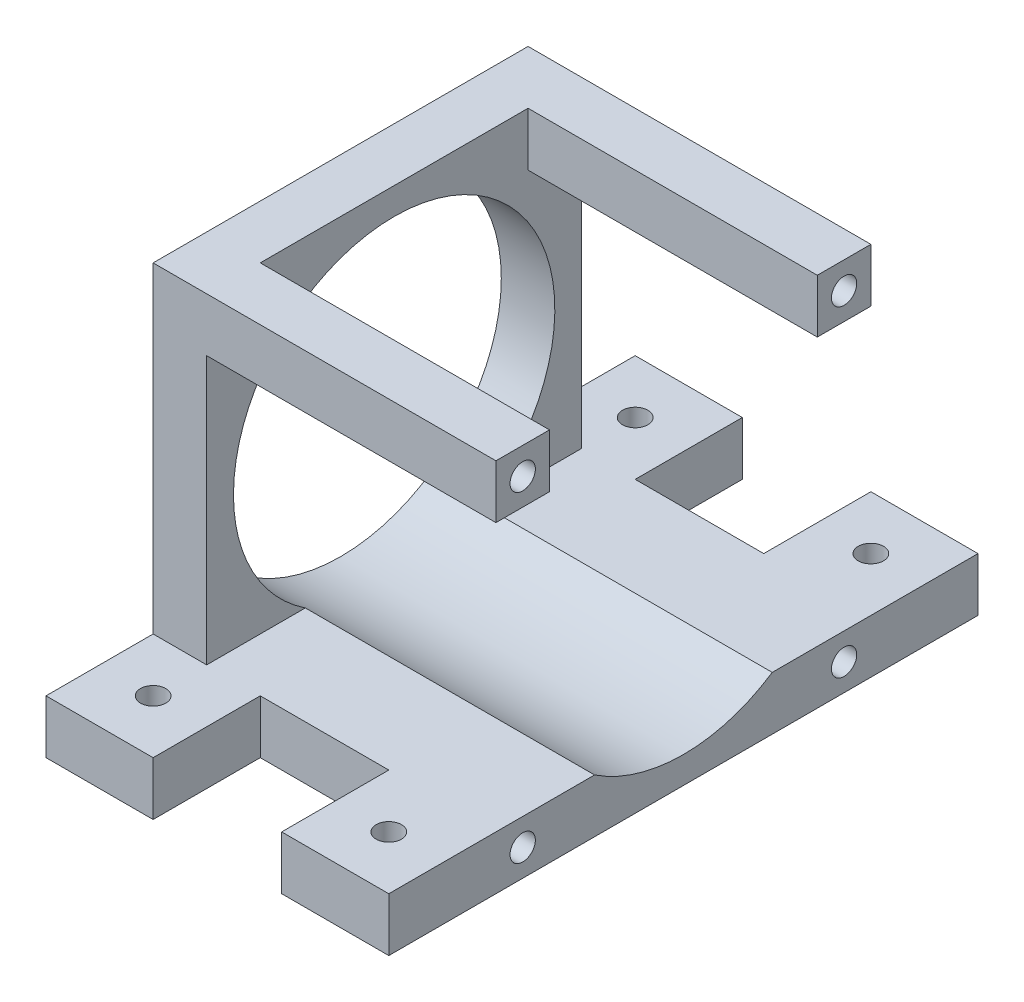
ISO-10303-21;
HEADER;
FILE_DESCRIPTION(('STEP AP214'),'2;1');
FILE_NAME('part.step','',(''),(''),'','','');
FILE_SCHEMA(('AUTOMOTIVE_DESIGN { 1 0 10303 214 1 1 1 1 }'));
ENDSEC;
DATA;
#1=APPLICATION_CONTEXT('core data for automotive mechanical design processes');
#2=APPLICATION_PROTOCOL_DEFINITION('international standard','automotive_design',2000,#1);
#3=PRODUCT_CONTEXT('',#1,'mechanical');
#4=PRODUCT('Part','Part','',(#3));
#5=PRODUCT_RELATED_PRODUCT_CATEGORY('part','',(#4));
#6=PRODUCT_DEFINITION_FORMATION('','',#4);
#7=PRODUCT_DEFINITION_CONTEXT('part definition',#1,'design');
#8=PRODUCT_DEFINITION('design','',#6,#7);
#9=PRODUCT_DEFINITION_SHAPE('','',#8);
#10=(LENGTH_UNIT() NAMED_UNIT(*) SI_UNIT(.MILLI.,.METRE.));
#11=(NAMED_UNIT(*) PLANE_ANGLE_UNIT() SI_UNIT($,.RADIAN.));
#12=(NAMED_UNIT(*) SI_UNIT($,.STERADIAN.) SOLID_ANGLE_UNIT());
#13=UNCERTAINTY_MEASURE_WITH_UNIT(LENGTH_MEASURE(1.E-05),#10,'distance_accuracy_value','');
#14=(GEOMETRIC_REPRESENTATION_CONTEXT(3) GLOBAL_UNCERTAINTY_ASSIGNED_CONTEXT((#13)) GLOBAL_UNIT_ASSIGNED_CONTEXT((#10,
#11,#12)) REPRESENTATION_CONTEXT('',''));
#15=CARTESIAN_POINT('',(0.,0.,0.));
#16=DIRECTION('',(0.,0.,1.));
#17=DIRECTION('',(1.,0.,0.));
#18=AXIS2_PLACEMENT_3D('',#15,#16,#17);
#19=CARTESIAN_POINT('',(0.,44.45,0.));
#20=DIRECTION('',(0.,0.,-1.));
#21=DIRECTION('',(-1.,0.,0.));
#22=AXIS2_PLACEMENT_3D('',#19,#20,#21);
#23=PLANE('',#22);
#24=DIRECTION('',(1.,0.,0.));
#25=VECTOR('',#24,1.);
#26=CARTESIAN_POINT('',(6.35,6.34999999999999,0.));
#27=LINE('',#26,#25);
#28=CARTESIAN_POINT('',(12.7,6.34999999999999,0.));
#29=VERTEX_POINT('',#28);
#30=CARTESIAN_POINT('',(27.94,6.34999999999999,0.));
#31=VERTEX_POINT('',#30);
#32=EDGE_CURVE('E58',#29,#31,#27,.T.);
#33=ORIENTED_EDGE('',*,*,#32,.F.);
#34=DIRECTION('',(0.,-1.,0.));
#35=VECTOR('',#34,1.);
#36=CARTESIAN_POINT('',(12.7,0.,0.));
#37=LINE('',#36,#35);
#38=CARTESIAN_POINT('',(12.7,0.,0.));
#39=VERTEX_POINT('',#38);
#40=EDGE_CURVE('E51',#29,#39,#37,.T.);
#41=ORIENTED_EDGE('',*,*,#40,.T.);
#42=DIRECTION('',(1.,0.,0.));
#43=VECTOR('',#42,1.);
#44=CARTESIAN_POINT('',(0.,0.,0.));
#45=LINE('',#44,#43);
#46=CARTESIAN_POINT('',(27.94,0.,0.));
#47=VERTEX_POINT('',#46);
#48=EDGE_CURVE('E37',#39,#47,#45,.T.);
#49=ORIENTED_EDGE('',*,*,#48,.T.);
#50=DIRECTION('',(0.,1.,0.));
#51=VECTOR('',#50,1.);
#52=CARTESIAN_POINT('',(27.94,0.,0.));
#53=LINE('',#52,#51);
#54=EDGE_CURVE('E236',#47,#31,#53,.T.);
#55=ORIENTED_EDGE('',*,*,#54,.T.);
#56=EDGE_LOOP('',(#33,#41,#49,#55));
#57=FACE_BOUND('',#56,.T.);
#58=ADVANCED_FACE('F33',(#57),#23,.F.);
#59=CARTESIAN_POINT('',(0.,44.45,-44.45));
#60=DIRECTION('',(0.,0.,1.));
#61=DIRECTION('',(1.,0.,0.));
#62=AXIS2_PLACEMENT_3D('',#59,#60,#61);
#63=PLANE('',#62);
#64=DIRECTION('',(1.,0.,0.));
#65=VECTOR('',#64,1.);
#66=CARTESIAN_POINT('',(0.,6.35,-44.45));
#67=LINE('',#66,#65);
#68=CARTESIAN_POINT('',(0.,6.35,-44.45));
#69=VERTEX_POINT('',#68);
#70=CARTESIAN_POINT('',(6.35,6.34999999999999,-44.45));
#71=VERTEX_POINT('',#70);
#72=EDGE_CURVE('E434',#69,#71,#67,.T.);
#73=ORIENTED_EDGE('',*,*,#72,.F.);
#74=DIRECTION('',(0.,-1.,0.));
#75=VECTOR('',#74,1.);
#76=CARTESIAN_POINT('',(0.,44.45,-44.45));
#77=LINE('',#76,#75);
#78=CARTESIAN_POINT('',(0.,44.45,-44.45));
#79=VERTEX_POINT('',#78);
#80=EDGE_CURVE('E302',#79,#69,#77,.T.);
#81=ORIENTED_EDGE('',*,*,#80,.F.);
#82=DIRECTION('',(-1.,0.,0.));
#83=VECTOR('',#82,1.);
#84=CARTESIAN_POINT('',(0.,44.45,-44.45));
#85=LINE('',#84,#83);
#86=CARTESIAN_POINT('',(40.64,44.45,-44.45));
#87=VERTEX_POINT('',#86);
#88=EDGE_CURVE('E301',#87,#79,#85,.T.);
#89=ORIENTED_EDGE('',*,*,#88,.F.);
#90=DIRECTION('',(0.,1.,0.));
#91=VECTOR('',#90,1.);
#92=CARTESIAN_POINT('',(40.64,44.45,-44.45));
#93=LINE('',#92,#91);
#94=CARTESIAN_POINT('',(40.64,38.1,-44.45));
#95=VERTEX_POINT('',#94);
#96=EDGE_CURVE('E352',#95,#87,#93,.T.);
#97=ORIENTED_EDGE('',*,*,#96,.F.);
#98=DIRECTION('',(-1.,0.,0.));
#99=VECTOR('',#98,1.);
#100=CARTESIAN_POINT('',(40.64,38.1,-44.45));
#101=LINE('',#100,#99);
#102=CARTESIAN_POINT('',(6.35,38.1,-44.45));
#103=VERTEX_POINT('',#102);
#104=EDGE_CURVE('E362',#95,#103,#101,.T.);
#105=ORIENTED_EDGE('',*,*,#104,.T.);
#106=DIRECTION('',(0.,-1.,0.));
#107=VECTOR('',#106,1.);
#108=CARTESIAN_POINT('',(6.35000000000001,44.45,-44.45));
#109=LINE('',#108,#107);
#110=EDGE_CURVE('E270',#103,#71,#109,.T.);
#111=ORIENTED_EDGE('',*,*,#110,.T.);
#112=EDGE_LOOP('',(#73,#81,#89,#97,#105,#111));
#113=FACE_BOUND('',#112,.T.);
#114=ADVANCED_FACE('F478',(#113),#63,.F.);
#115=DIRECTION('',(0.,-1.,0.));
#116=VECTOR('',#115,1.);
#117=CARTESIAN_POINT('',(12.7,0.,-44.45));
#118=LINE('',#117,#116);
#119=CARTESIAN_POINT('',(12.7,6.35,-44.45));
#120=VERTEX_POINT('',#119);
#121=CARTESIAN_POINT('',(12.7,0.,-44.45));
#122=VERTEX_POINT('',#121);
#123=EDGE_CURVE('E402',#120,#122,#118,.T.);
#124=ORIENTED_EDGE('',*,*,#123,.F.);
#125=DIRECTION('',(1.,0.,0.));
#126=VECTOR('',#125,1.);
#127=CARTESIAN_POINT('',(6.35,6.34999999999999,-44.45));
#128=LINE('',#127,#126);
#129=CARTESIAN_POINT('',(27.94,6.35,-44.45));
#130=VERTEX_POINT('',#129);
#131=EDGE_CURVE('E258',#120,#130,#128,.T.);
#132=ORIENTED_EDGE('',*,*,#131,.T.);
#133=DIRECTION('',(0.,1.,0.));
#134=VECTOR('',#133,1.);
#135=CARTESIAN_POINT('',(27.94,0.,-44.45));
#136=LINE('',#135,#134);
#137=CARTESIAN_POINT('',(27.94,0.,-44.45));
#138=VERTEX_POINT('',#137);
#139=EDGE_CURVE('E313',#138,#130,#136,.T.);
#140=ORIENTED_EDGE('',*,*,#139,.F.);
#141=DIRECTION('',(-1.,0.,0.));
#142=VECTOR('',#141,1.);
#143=CARTESIAN_POINT('',(0.,0.,-44.45));
#144=LINE('',#143,#142);
#145=EDGE_CURVE('E299',#138,#122,#144,.T.);
#146=ORIENTED_EDGE('',*,*,#145,.T.);
#147=EDGE_LOOP('',(#124,#132,#140,#146));
#148=FACE_BOUND('',#147,.T.);
#149=ADVANCED_FACE('F399',(#148),#63,.F.);
#150=CARTESIAN_POINT('',(6.35000000000001,44.45,0.));
#151=DIRECTION('',(1.,0.,0.));
#152=DIRECTION('',(0.,1.,0.));
#153=AXIS2_PLACEMENT_3D('',#150,#151,#152);
#154=PLANE('',#153);
#155=DIRECTION('',(0.,0.,-1.));
#156=VECTOR('',#155,1.);
#157=CARTESIAN_POINT('',(6.35,38.1,-44.45));
#158=LINE('',#157,#156);
#159=CARTESIAN_POINT('',(6.35,38.1,-38.1));
#160=VERTEX_POINT('',#159);
#161=EDGE_CURVE('E356',#160,#103,#158,.T.);
#162=ORIENTED_EDGE('',*,*,#161,.F.);
#163=DIRECTION('',(0.,-1.,0.));
#164=VECTOR('',#163,1.);
#165=CARTESIAN_POINT('',(6.35000000000001,44.45,-38.1));
#166=LINE('',#165,#164);
#167=CARTESIAN_POINT('',(6.35000000000001,44.45,-38.1));
#168=VERTEX_POINT('',#167);
#169=EDGE_CURVE('E349',#168,#160,#166,.T.);
#170=ORIENTED_EDGE('',*,*,#169,.F.);
#171=DIRECTION('',(0.,0.,-1.));
#172=VECTOR('',#171,1.);
#173=CARTESIAN_POINT('',(6.35000000000001,44.45,0.));
#174=LINE('',#173,#172);
#175=CARTESIAN_POINT('',(6.35000000000001,44.45,-6.35));
#176=VERTEX_POINT('',#175);
#177=EDGE_CURVE('E281',#176,#168,#174,.T.);
#178=ORIENTED_EDGE('',*,*,#177,.F.);
#179=DIRECTION('',(0.,1.,0.));
#180=VECTOR('',#179,1.);
#181=CARTESIAN_POINT('',(6.35000000000001,44.45,-6.35));
#182=LINE('',#181,#180);
#183=CARTESIAN_POINT('',(6.35,38.1,-6.35));
#184=VERTEX_POINT('',#183);
#185=EDGE_CURVE('E377',#184,#176,#182,.T.);
#186=ORIENTED_EDGE('',*,*,#185,.F.);
#187=DIRECTION('',(0.,0.,-1.));
#188=VECTOR('',#187,1.);
#189=CARTESIAN_POINT('',(6.35,38.1,0.));
#190=LINE('',#189,#188);
#191=CARTESIAN_POINT('',(6.35,38.1,0.));
#192=VERTEX_POINT('',#191);
#193=EDGE_CURVE('E372',#192,#184,#190,.T.);
#194=ORIENTED_EDGE('',*,*,#193,.F.);
#195=DIRECTION('',(0.,-1.,0.));
#196=VECTOR('',#195,1.);
#197=CARTESIAN_POINT('',(6.35000000000001,44.45,0.));
#198=LINE('',#197,#196);
#199=CARTESIAN_POINT('',(6.35,6.34999999999999,0.));
#200=VERTEX_POINT('',#199);
#201=EDGE_CURVE('E269',#192,#200,#198,.T.);
#202=ORIENTED_EDGE('',*,*,#201,.T.);
#203=DIRECTION('',(0.,0.,-1.));
#204=VECTOR('',#203,1.);
#205=CARTESIAN_POINT('',(6.35,6.34999999999999,0.));
#206=LINE('',#205,#204);
#207=CARTESIAN_POINT('',(6.35,6.34999999999999,-11.6947162906216));
#208=VERTEX_POINT('',#207);
#209=EDGE_CURVE('E285',#200,#208,#206,.T.);
#210=ORIENTED_EDGE('',*,*,#209,.T.);
#211=CARTESIAN_POINT('',(6.35,22.225,-22.225));
#212=DIRECTION('',(1.,0.,0.));
#213=DIRECTION('',(0.,1.,0.));
#214=AXIS2_PLACEMENT_3D('',#211,#212,#213);
#215=CIRCLE('',#214,19.05);
#216=CARTESIAN_POINT('',(6.35,6.34999999999999,-32.7552837093784));
#217=VERTEX_POINT('',#216);
#218=EDGE_CURVE('E43',#208,#217,#215,.F.);
#219=ORIENTED_EDGE('',*,*,#218,.T.);
#220=EDGE_CURVE('E288',#217,#71,#206,.T.);
#221=ORIENTED_EDGE('',*,*,#220,.T.);
#222=ORIENTED_EDGE('',*,*,#110,.F.);
#223=EDGE_LOOP('',(#162,#170,#178,#186,#194,#202,#210,#219,#221,#222));
#224=FACE_BOUND('',#223,.T.);
#225=ADVANCED_FACE('F489',(#224),#154,.T.);
#226=DIRECTION('',(0.,-1.,0.));
#227=VECTOR('',#226,1.);
#228=CARTESIAN_POINT('',(0.,44.45,0.));
#229=LINE('',#228,#227);
#230=CARTESIAN_POINT('',(0.,44.45,0.));
#231=VERTEX_POINT('',#230);
#232=CARTESIAN_POINT('',(0.,6.35,0.));
#233=VERTEX_POINT('',#232);
#234=EDGE_CURVE('E501',#231,#233,#229,.T.);
#235=ORIENTED_EDGE('',*,*,#234,.T.);
#236=DIRECTION('',(1.,0.,0.));
#237=VECTOR('',#236,1.);
#238=CARTESIAN_POINT('',(0.,6.35,0.));
#239=LINE('',#238,#237);
#240=EDGE_CURVE('E217',#233,#200,#239,.T.);
#241=ORIENTED_EDGE('',*,*,#240,.T.);
#242=ORIENTED_EDGE('',*,*,#201,.F.);
#243=DIRECTION('',(-1.,0.,0.));
#244=VECTOR('',#243,1.);
#245=CARTESIAN_POINT('',(40.64,38.1,0.));
#246=LINE('',#245,#244);
#247=CARTESIAN_POINT('',(40.64,38.1,0.));
#248=VERTEX_POINT('',#247);
#249=EDGE_CURVE('E274',#248,#192,#246,.T.);
#250=ORIENTED_EDGE('',*,*,#249,.F.);
#251=DIRECTION('',(0.,-1.,0.));
#252=VECTOR('',#251,1.);
#253=CARTESIAN_POINT('',(40.64,44.45,0.));
#254=LINE('',#253,#252);
#255=CARTESIAN_POINT('',(40.64,44.45,0.));
#256=VERTEX_POINT('',#255);
#257=EDGE_CURVE('E373',#256,#248,#254,.T.);
#258=ORIENTED_EDGE('',*,*,#257,.F.);
#259=DIRECTION('',(1.,0.,0.));
#260=VECTOR('',#259,1.);
#261=CARTESIAN_POINT('',(0.,44.45,0.));
#262=LINE('',#261,#260);
#263=EDGE_CURVE('E298',#231,#256,#262,.T.);
#264=ORIENTED_EDGE('',*,*,#263,.F.);
#265=EDGE_LOOP('',(#235,#241,#242,#250,#258,#264));
#266=FACE_BOUND('',#265,.T.);
#267=ADVANCED_FACE('F480',(#266),#23,.F.);
#268=CARTESIAN_POINT('',(40.64,44.45,0.));
#269=DIRECTION('',(-1.,0.,0.));
#270=DIRECTION('',(0.,0.,1.));
#271=AXIS2_PLACEMENT_3D('',#268,#269,#270);
#272=PLANE('',#271);
#273=CARTESIAN_POINT('',(40.64,3.175,-3.175));
#274=DIRECTION('',(1.,0.,0.));
#275=DIRECTION('',(0.,1.,0.));
#276=AXIS2_PLACEMENT_3D('',#273,#274,#275);
#277=CIRCLE('',#276,1.5);
#278=CARTESIAN_POINT('',(40.64,4.675,-3.175));
#279=VERTEX_POINT('',#278);
#280=EDGE_CURVE('E330',#279,#279,#277,.T.);
#281=ORIENTED_EDGE('',*,*,#280,.F.);
#282=EDGE_LOOP('',(#281));
#283=FACE_BOUND('',#282,.T.);
#284=CARTESIAN_POINT('',(40.64,3.17499999999999,-41.275));
#285=DIRECTION('',(1.,0.,0.));
#286=DIRECTION('',(0.,1.,0.));
#287=AXIS2_PLACEMENT_3D('',#284,#285,#286);
#288=CIRCLE('',#287,1.5);
#289=CARTESIAN_POINT('',(40.64,4.675,-41.275));
#290=VERTEX_POINT('',#289);
#291=EDGE_CURVE('E329',#290,#290,#288,.T.);
#292=ORIENTED_EDGE('',*,*,#291,.F.);
#293=EDGE_LOOP('',(#292));
#294=FACE_BOUND('',#293,.T.);
#295=DIRECTION('',(0.,0.,-1.));
#296=VECTOR('',#295,1.);
#297=CARTESIAN_POINT('',(40.64,6.34999999999999,0.));
#298=LINE('',#297,#296);
#299=CARTESIAN_POINT('',(40.64,6.35,12.7));
#300=VERTEX_POINT('',#299);
#301=CARTESIAN_POINT('',(40.64,6.34999999999999,-11.6947162906216));
#302=VERTEX_POINT('',#301);
#303=EDGE_CURVE('E289',#300,#302,#298,.T.);
#304=ORIENTED_EDGE('',*,*,#303,.F.);
#305=DIRECTION('',(0.,-1.,0.));
#306=VECTOR('',#305,1.);
#307=CARTESIAN_POINT('',(40.64,0.,12.7));
#308=LINE('',#307,#306);
#309=CARTESIAN_POINT('',(40.64,0.,12.7));
#310=VERTEX_POINT('',#309);
#311=EDGE_CURVE('E237',#300,#310,#308,.T.);
#312=ORIENTED_EDGE('',*,*,#311,.T.);
#313=DIRECTION('',(0.,0.,-1.));
#314=VECTOR('',#313,1.);
#315=CARTESIAN_POINT('',(40.64,0.,0.));
#316=LINE('',#315,#314);
#317=CARTESIAN_POINT('',(40.64,0.,-57.15));
#318=VERTEX_POINT('',#317);
#319=EDGE_CURVE('E305',#310,#318,#316,.T.);
#320=ORIENTED_EDGE('',*,*,#319,.T.);
#321=DIRECTION('',(0.,-1.,0.));
#322=VECTOR('',#321,1.);
#323=CARTESIAN_POINT('',(40.64,0.,-57.15));
#324=LINE('',#323,#322);
#325=CARTESIAN_POINT('',(40.64,6.35,-57.15));
#326=VERTEX_POINT('',#325);
#327=EDGE_CURVE('E317',#326,#318,#324,.T.);
#328=ORIENTED_EDGE('',*,*,#327,.F.);
#329=CARTESIAN_POINT('',(40.64,6.34999999999999,-32.7552837093784));
#330=VERTEX_POINT('',#329);
#331=EDGE_CURVE('E277',#330,#326,#298,.T.);
#332=ORIENTED_EDGE('',*,*,#331,.F.);
#333=CARTESIAN_POINT('',(40.64,22.225,-22.225));
#334=DIRECTION('',(-1.,0.,0.));
#335=DIRECTION('',(0.,0.,1.));
#336=AXIS2_PLACEMENT_3D('',#333,#334,#335);
#337=CIRCLE('',#336,19.05);
#338=EDGE_CURVE('E207',#330,#302,#337,.T.);
#339=ORIENTED_EDGE('',*,*,#338,.T.);
#340=EDGE_LOOP('',(#304,#312,#320,#328,#332,#339));
#341=FACE_BOUND('',#340,.T.);
#342=ADVANCED_FACE('F488',(#283,#294,#341),#272,.F.);
#343=CARTESIAN_POINT('',(0.,44.45,0.));
#344=DIRECTION('',(0.,-1.,0.));
#345=DIRECTION('',(0.,0.,-1.));
#346=AXIS2_PLACEMENT_3D('',#343,#344,#345);
#347=PLANE('',#346);
#348=ORIENTED_EDGE('',*,*,#263,.T.);
#349=DIRECTION('',(0.,0.,1.));
#350=VECTOR('',#349,1.);
#351=CARTESIAN_POINT('',(40.64,44.45,0.));
#352=LINE('',#351,#350);
#353=CARTESIAN_POINT('',(40.64,44.45,-6.35));
#354=VERTEX_POINT('',#353);
#355=EDGE_CURVE('E381',#354,#256,#352,.T.);
#356=ORIENTED_EDGE('',*,*,#355,.F.);
#357=DIRECTION('',(-1.,0.,0.));
#358=VECTOR('',#357,1.);
#359=CARTESIAN_POINT('',(40.64,44.45,-6.35));
#360=LINE('',#359,#358);
#361=EDGE_CURVE('E384',#354,#176,#360,.T.);
#362=ORIENTED_EDGE('',*,*,#361,.T.);
#363=ORIENTED_EDGE('',*,*,#177,.T.);
#364=DIRECTION('',(-1.,0.,0.));
#365=VECTOR('',#364,1.);
#366=CARTESIAN_POINT('',(40.64,44.45,-38.1));
#367=LINE('',#366,#365);
#368=CARTESIAN_POINT('',(40.64,44.45,-38.1));
#369=VERTEX_POINT('',#368);
#370=EDGE_CURVE('E370',#369,#168,#367,.T.);
#371=ORIENTED_EDGE('',*,*,#370,.F.);
#372=DIRECTION('',(0.,0.,1.));
#373=VECTOR('',#372,1.);
#374=CARTESIAN_POINT('',(40.64,44.45,-44.45));
#375=LINE('',#374,#373);
#376=EDGE_CURVE('E355',#87,#369,#375,.T.);
#377=ORIENTED_EDGE('',*,*,#376,.F.);
#378=ORIENTED_EDGE('',*,*,#88,.T.);
#379=DIRECTION('',(0.,0.,1.));
#380=VECTOR('',#379,1.);
#381=CARTESIAN_POINT('',(0.,44.45,0.));
#382=LINE('',#381,#380);
#383=EDGE_CURVE('E295',#79,#231,#382,.T.);
#384=ORIENTED_EDGE('',*,*,#383,.T.);
#385=EDGE_LOOP('',(#348,#356,#362,#363,#371,#377,#378,#384));
#386=FACE_BOUND('',#385,.T.);
#387=ADVANCED_FACE('F495',(#386),#347,.F.);
#388=CARTESIAN_POINT('',(40.64,22.225,-22.225));
#389=DIRECTION('',(-1.,0.,0.));
#390=DIRECTION('',(0.,0.,1.));
#391=AXIS2_PLACEMENT_3D('',#388,#389,#390);
#392=CYLINDRICAL_SURFACE('',#391,19.05);
#393=CARTESIAN_POINT('',(0.,22.225,-22.225));
#394=DIRECTION('',(-1.,0.,0.));
#395=DIRECTION('',(0.,0.,1.));
#396=AXIS2_PLACEMENT_3D('',#393,#394,#395);
#397=CIRCLE('',#396,19.05);
#398=CARTESIAN_POINT('',(0.,22.225,-3.175));
#399=VERTEX_POINT('',#398);
#400=EDGE_CURVE('E284',#399,#399,#397,.T.);
#401=ORIENTED_EDGE('',*,*,#400,.T.);
#402=EDGE_LOOP('',(#401));
#403=FACE_BOUND('',#402,.T.);
#404=DIRECTION('',(-1.,0.,0.));
#405=VECTOR('',#404,1.);
#406=CARTESIAN_POINT('',(40.64,6.34999999999999,-32.7552837093784));
#407=LINE('',#406,#405);
#408=EDGE_CURVE('E11',#217,#330,#407,.F.);
#409=ORIENTED_EDGE('',*,*,#408,.F.);
#410=ORIENTED_EDGE('',*,*,#218,.F.);
#411=DIRECTION('',(-1.,0.,0.));
#412=VECTOR('',#411,1.);
#413=CARTESIAN_POINT('',(40.64,6.34999999999999,-11.6947162906216));
#414=LINE('',#413,#412);
#415=EDGE_CURVE('E506',#302,#208,#414,.T.);
#416=ORIENTED_EDGE('',*,*,#415,.F.);
#417=ORIENTED_EDGE('',*,*,#338,.F.);
#418=EDGE_LOOP('',(#409,#410,#416,#417));
#419=FACE_BOUND('',#418,.T.);
#420=ADVANCED_FACE('F520',(#403,#419),#392,.F.);
#421=CARTESIAN_POINT('',(0.,44.45,0.));
#422=DIRECTION('',(1.,0.,0.));
#423=DIRECTION('',(0.,0.,-1.));
#424=AXIS2_PLACEMENT_3D('',#421,#422,#423);
#425=PLANE('',#424);
#426=ORIENTED_EDGE('',*,*,#400,.F.);
#427=EDGE_LOOP('',(#426));
#428=FACE_BOUND('',#427,.T.);
#429=DIRECTION('',(0.,0.,1.));
#430=VECTOR('',#429,1.);
#431=CARTESIAN_POINT('',(0.,0.,0.));
#432=LINE('',#431,#430);
#433=CARTESIAN_POINT('',(0.,0.,-57.15));
#434=VERTEX_POINT('',#433);
#435=CARTESIAN_POINT('',(0.,0.,12.7));
#436=VERTEX_POINT('',#435);
#437=EDGE_CURVE('E196',#434,#436,#432,.T.);
#438=ORIENTED_EDGE('',*,*,#437,.T.);
#439=DIRECTION('',(0.,1.,0.));
#440=VECTOR('',#439,1.);
#441=CARTESIAN_POINT('',(0.,0.,12.7));
#442=LINE('',#441,#440);
#443=CARTESIAN_POINT('',(0.,6.35,12.7));
#444=VERTEX_POINT('',#443);
#445=EDGE_CURVE('E198',#436,#444,#442,.T.);
#446=ORIENTED_EDGE('',*,*,#445,.T.);
#447=DIRECTION('',(0.,0.,-1.));
#448=VECTOR('',#447,1.);
#449=CARTESIAN_POINT('',(0.,6.35,12.7));
#450=LINE('',#449,#448);
#451=EDGE_CURVE('E228',#444,#233,#450,.T.);
#452=ORIENTED_EDGE('',*,*,#451,.T.);
#453=ORIENTED_EDGE('',*,*,#234,.F.);
#454=ORIENTED_EDGE('',*,*,#383,.F.);
#455=ORIENTED_EDGE('',*,*,#80,.T.);
#456=DIRECTION('',(0.,0.,1.));
#457=VECTOR('',#456,1.);
#458=CARTESIAN_POINT('',(0.,6.35,-57.15));
#459=LINE('',#458,#457);
#460=CARTESIAN_POINT('',(0.,6.35,-57.15));
#461=VERTEX_POINT('',#460);
#462=EDGE_CURVE('E318',#461,#69,#459,.T.);
#463=ORIENTED_EDGE('',*,*,#462,.F.);
#464=DIRECTION('',(0.,1.,0.));
#465=VECTOR('',#464,1.);
#466=CARTESIAN_POINT('',(0.,0.,-57.15));
#467=LINE('',#466,#465);
#468=EDGE_CURVE('E202',#434,#461,#467,.T.);
#469=ORIENTED_EDGE('',*,*,#468,.F.);
#470=EDGE_LOOP('',(#438,#446,#452,#453,#454,#455,#463,#469));
#471=FACE_BOUND('',#470,.T.);
#472=ADVANCED_FACE('F35',(#428,#471),#425,.F.);
#473=CARTESIAN_POINT('',(0.,0.,0.));
#474=DIRECTION('',(0.,-1.,0.));
#475=DIRECTION('',(0.,0.,-1.));
#476=AXIS2_PLACEMENT_3D('',#473,#474,#475);
#477=PLANE('',#476);
#478=CARTESIAN_POINT('',(34.29,0.,6.34999999999999));
#479=DIRECTION('',(0.,-1.,0.));
#480=DIRECTION('',(0.,0.,-1.));
#481=AXIS2_PLACEMENT_3D('',#478,#479,#480);
#482=CIRCLE('',#481,1.5);
#483=CARTESIAN_POINT('',(34.29,0.,4.84999999999999));
#484=VERTEX_POINT('',#483);
#485=EDGE_CURVE('E579',#484,#484,#482,.F.);
#486=ORIENTED_EDGE('',*,*,#485,.T.);
#487=EDGE_LOOP('',(#486));
#488=FACE_BOUND('',#487,.T.);
#489=CARTESIAN_POINT('',(6.34999999999999,0.,6.34999999999999));
#490=DIRECTION('',(0.,-1.,0.));
#491=DIRECTION('',(0.,0.,-1.));
#492=AXIS2_PLACEMENT_3D('',#489,#490,#491);
#493=CIRCLE('',#492,1.5);
#494=CARTESIAN_POINT('',(6.34999999999999,0.,4.85));
#495=VERTEX_POINT('',#494);
#496=EDGE_CURVE('E230',#495,#495,#493,.F.);
#497=ORIENTED_EDGE('',*,*,#496,.T.);
#498=EDGE_LOOP('',(#497));
#499=FACE_BOUND('',#498,.T.);
#500=CARTESIAN_POINT('',(34.29,0.,-50.8));
#501=DIRECTION('',(0.,-1.,0.));
#502=DIRECTION('',(0.,0.,-1.));
#503=AXIS2_PLACEMENT_3D('',#500,#501,#502);
#504=CIRCLE('',#503,1.5);
#505=CARTESIAN_POINT('',(34.29,0.,-52.3));
#506=VERTEX_POINT('',#505);
#507=EDGE_CURVE('E448',#506,#506,#504,.T.);
#508=ORIENTED_EDGE('',*,*,#507,.F.);
#509=EDGE_LOOP('',(#508));
#510=FACE_BOUND('',#509,.T.);
#511=CARTESIAN_POINT('',(6.34999999999999,0.,-50.8));
#512=DIRECTION('',(0.,-1.,0.));
#513=DIRECTION('',(0.,0.,-1.));
#514=AXIS2_PLACEMENT_3D('',#511,#512,#513);
#515=CIRCLE('',#514,1.5);
#516=CARTESIAN_POINT('',(6.34999999999999,0.,-52.3));
#517=VERTEX_POINT('',#516);
#518=EDGE_CURVE('E437',#517,#517,#515,.T.);
#519=ORIENTED_EDGE('',*,*,#518,.F.);
#520=EDGE_LOOP('',(#519));
#521=FACE_BOUND('',#520,.T.);
#522=ORIENTED_EDGE('',*,*,#437,.F.);
#523=DIRECTION('',(-1.,0.,0.));
#524=VECTOR('',#523,1.);
#525=CARTESIAN_POINT('',(0.,0.,-57.15));
#526=LINE('',#525,#524);
#527=CARTESIAN_POINT('',(12.7,0.,-57.15));
#528=VERTEX_POINT('',#527);
#529=EDGE_CURVE('E432',#528,#434,#526,.T.);
#530=ORIENTED_EDGE('',*,*,#529,.F.);
#531=DIRECTION('',(0.,0.,1.));
#532=VECTOR('',#531,1.);
#533=CARTESIAN_POINT('',(12.7,0.,-57.15));
#534=LINE('',#533,#532);
#535=EDGE_CURVE('E429',#528,#122,#534,.T.);
#536=ORIENTED_EDGE('',*,*,#535,.T.);
#537=ORIENTED_EDGE('',*,*,#145,.F.);
#538=DIRECTION('',(0.,0.,1.));
#539=VECTOR('',#538,1.);
#540=CARTESIAN_POINT('',(27.94,0.,-57.15));
#541=LINE('',#540,#539);
#542=CARTESIAN_POINT('',(27.94,0.,-57.15));
#543=VERTEX_POINT('',#542);
#544=EDGE_CURVE('E333',#543,#138,#541,.T.);
#545=ORIENTED_EDGE('',*,*,#544,.F.);
#546=DIRECTION('',(-1.,0.,0.));
#547=VECTOR('',#546,1.);
#548=CARTESIAN_POINT('',(40.64,0.,-57.15));
#549=LINE('',#548,#547);
#550=EDGE_CURVE('E421',#318,#543,#549,.T.);
#551=ORIENTED_EDGE('',*,*,#550,.F.);
#552=ORIENTED_EDGE('',*,*,#319,.F.);
#553=DIRECTION('',(-1.,0.,0.));
#554=VECTOR('',#553,1.);
#555=CARTESIAN_POINT('',(40.64,0.,12.7));
#556=LINE('',#555,#554);
#557=CARTESIAN_POINT('',(27.94,0.,12.7));
#558=VERTEX_POINT('',#557);
#559=EDGE_CURVE('E246',#310,#558,#556,.T.);
#560=ORIENTED_EDGE('',*,*,#559,.T.);
#561=DIRECTION('',(0.,0.,-1.));
#562=VECTOR('',#561,1.);
#563=CARTESIAN_POINT('',(27.94,0.,12.7));
#564=LINE('',#563,#562);
#565=EDGE_CURVE('E249',#558,#47,#564,.T.);
#566=ORIENTED_EDGE('',*,*,#565,.T.);
#567=ORIENTED_EDGE('',*,*,#48,.F.);
#568=DIRECTION('',(0.,0.,-1.));
#569=VECTOR('',#568,1.);
#570=CARTESIAN_POINT('',(12.7,0.,12.7));
#571=LINE('',#570,#569);
#572=CARTESIAN_POINT('',(12.7,0.,12.7));
#573=VERTEX_POINT('',#572);
#574=EDGE_CURVE('E221',#573,#39,#571,.T.);
#575=ORIENTED_EDGE('',*,*,#574,.F.);
#576=DIRECTION('',(-1.,0.,0.));
#577=VECTOR('',#576,1.);
#578=CARTESIAN_POINT('',(0.,0.,12.7));
#579=LINE('',#578,#577);
#580=EDGE_CURVE('E213',#573,#436,#579,.T.);
#581=ORIENTED_EDGE('',*,*,#580,.T.);
#582=EDGE_LOOP('',(#522,#530,#536,#537,#545,#551,#552,#560,#566,#567,#575,#581));
#583=FACE_BOUND('',#582,.T.);
#584=ADVANCED_FACE('F219',(#488,#499,#510,#521,#583),#477,.T.);
#585=CARTESIAN_POINT('',(6.35,6.34999999999999,0.));
#586=DIRECTION('',(0.,1.,0.));
#587=DIRECTION('',(-1.,0.,0.));
#588=AXIS2_PLACEMENT_3D('',#585,#586,#587);
#589=PLANE('',#588);
#590=CARTESIAN_POINT('',(34.29,6.34999999999999,-50.8));
#591=DIRECTION('',(0.,1.,0.));
#592=DIRECTION('',(-1.,0.,0.));
#593=AXIS2_PLACEMENT_3D('',#590,#591,#592);
#594=CIRCLE('',#593,1.5);
#595=CARTESIAN_POINT('',(32.79,6.34999999999999,-50.8));
#596=VERTEX_POINT('',#595);
#597=EDGE_CURVE('E252',#596,#596,#594,.T.);
#598=ORIENTED_EDGE('',*,*,#597,.F.);
#599=EDGE_LOOP('',(#598));
#600=FACE_BOUND('',#599,.T.);
#601=CARTESIAN_POINT('',(6.34999999999999,6.34999999999999,-50.8));
#602=DIRECTION('',(0.,1.,0.));
#603=DIRECTION('',(-1.,0.,0.));
#604=AXIS2_PLACEMENT_3D('',#601,#602,#603);
#605=CIRCLE('',#604,1.5);
#606=CARTESIAN_POINT('',(4.84999999999999,6.34999999999999,-50.8));
#607=VERTEX_POINT('',#606);
#608=EDGE_CURVE('E446',#607,#607,#605,.T.);
#609=ORIENTED_EDGE('',*,*,#608,.F.);
#610=EDGE_LOOP('',(#609));
#611=FACE_BOUND('',#610,.T.);
#612=ORIENTED_EDGE('',*,*,#408,.T.);
#613=ORIENTED_EDGE('',*,*,#331,.T.);
#614=DIRECTION('',(1.,0.,0.));
#615=VECTOR('',#614,1.);
#616=CARTESIAN_POINT('',(40.64,6.35,-57.15));
#617=LINE('',#616,#615);
#618=CARTESIAN_POINT('',(27.94,6.35,-57.15));
#619=VERTEX_POINT('',#618);
#620=EDGE_CURVE('E324',#619,#326,#617,.T.);
#621=ORIENTED_EDGE('',*,*,#620,.F.);
#622=DIRECTION('',(0.,0.,1.));
#623=VECTOR('',#622,1.);
#624=CARTESIAN_POINT('',(27.94,6.35,-57.15));
#625=LINE('',#624,#623);
#626=EDGE_CURVE('E319',#619,#130,#625,.T.);
#627=ORIENTED_EDGE('',*,*,#626,.T.);
#628=ORIENTED_EDGE('',*,*,#131,.F.);
#629=DIRECTION('',(0.,0.,1.));
#630=VECTOR('',#629,1.);
#631=CARTESIAN_POINT('',(12.7,6.35,-57.15));
#632=LINE('',#631,#630);
#633=CARTESIAN_POINT('',(12.7,6.35,-57.15));
#634=VERTEX_POINT('',#633);
#635=EDGE_CURVE('E427',#634,#120,#632,.T.);
#636=ORIENTED_EDGE('',*,*,#635,.F.);
#637=DIRECTION('',(1.,0.,0.));
#638=VECTOR('',#637,1.);
#639=CARTESIAN_POINT('',(0.,6.35,-57.15));
#640=LINE('',#639,#638);
#641=EDGE_CURVE('E441',#461,#634,#640,.T.);
#642=ORIENTED_EDGE('',*,*,#641,.F.);
#643=ORIENTED_EDGE('',*,*,#462,.T.);
#644=ORIENTED_EDGE('',*,*,#72,.T.);
#645=ORIENTED_EDGE('',*,*,#220,.F.);
#646=EDGE_LOOP('',(#612,#613,#621,#627,#628,#636,#642,#643,#644,#645));
#647=FACE_BOUND('',#646,.T.);
#648=ADVANCED_FACE('F414',(#600,#611,#647),#589,.T.);
#649=CARTESIAN_POINT('',(34.29,6.34999999999999,6.34999999999999));
#650=DIRECTION('',(0.,-1.,0.));
#651=DIRECTION('',(-1.,0.,0.));
#652=AXIS2_PLACEMENT_3D('',#649,#650,#651);
#653=CIRCLE('',#652,1.5);
#654=CARTESIAN_POINT('',(32.79,6.34999999999999,6.34999999999999));
#655=VERTEX_POINT('',#654);
#656=EDGE_CURVE('E582',#655,#655,#653,.T.);
#657=ORIENTED_EDGE('',*,*,#656,.T.);
#658=EDGE_LOOP('',(#657));
#659=FACE_BOUND('',#658,.T.);
#660=CARTESIAN_POINT('',(6.34999999999999,6.34999999999999,6.34999999999999));
#661=DIRECTION('',(0.,-1.,0.));
#662=DIRECTION('',(-1.,0.,0.));
#663=AXIS2_PLACEMENT_3D('',#660,#661,#662);
#664=CIRCLE('',#663,1.5);
#665=CARTESIAN_POINT('',(4.84999999999999,6.34999999999999,6.34999999999999));
#666=VERTEX_POINT('',#665);
#667=EDGE_CURVE('E585',#666,#666,#664,.T.);
#668=ORIENTED_EDGE('',*,*,#667,.T.);
#669=EDGE_LOOP('',(#668));
#670=FACE_BOUND('',#669,.T.);
#671=ORIENTED_EDGE('',*,*,#415,.T.);
#672=ORIENTED_EDGE('',*,*,#209,.F.);
#673=ORIENTED_EDGE('',*,*,#240,.F.);
#674=ORIENTED_EDGE('',*,*,#451,.F.);
#675=DIRECTION('',(1.,0.,0.));
#676=VECTOR('',#675,1.);
#677=CARTESIAN_POINT('',(0.,6.35,12.7));
#678=LINE('',#677,#676);
#679=CARTESIAN_POINT('',(12.7,6.35,12.7));
#680=VERTEX_POINT('',#679);
#681=EDGE_CURVE('E216',#444,#680,#678,.T.);
#682=ORIENTED_EDGE('',*,*,#681,.T.);
#683=DIRECTION('',(0.,0.,-1.));
#684=VECTOR('',#683,1.);
#685=CARTESIAN_POINT('',(12.7,6.35,12.7));
#686=LINE('',#685,#684);
#687=EDGE_CURVE('E233',#680,#29,#686,.T.);
#688=ORIENTED_EDGE('',*,*,#687,.T.);
#689=ORIENTED_EDGE('',*,*,#32,.T.);
#690=DIRECTION('',(0.,0.,-1.));
#691=VECTOR('',#690,1.);
#692=CARTESIAN_POINT('',(27.94,6.35,12.7));
#693=LINE('',#692,#691);
#694=CARTESIAN_POINT('',(27.94,6.35,12.7));
#695=VERTEX_POINT('',#694);
#696=EDGE_CURVE('E261',#695,#31,#693,.T.);
#697=ORIENTED_EDGE('',*,*,#696,.F.);
#698=DIRECTION('',(1.,0.,0.));
#699=VECTOR('',#698,1.);
#700=CARTESIAN_POINT('',(40.64,6.35,12.7));
#701=LINE('',#700,#699);
#702=EDGE_CURVE('E240',#695,#300,#701,.T.);
#703=ORIENTED_EDGE('',*,*,#702,.T.);
#704=ORIENTED_EDGE('',*,*,#303,.T.);
#705=EDGE_LOOP('',(#671,#672,#673,#674,#682,#688,#689,#697,#703,#704));
#706=FACE_BOUND('',#705,.T.);
#707=ADVANCED_FACE('F459',(#659,#670,#706),#589,.T.);
#708=CARTESIAN_POINT('',(40.64,38.1,0.));
#709=DIRECTION('',(0.,1.,0.));
#710=DIRECTION('',(-1.,0.,0.));
#711=AXIS2_PLACEMENT_3D('',#708,#709,#710);
#712=PLANE('',#711);
#713=ORIENTED_EDGE('',*,*,#193,.T.);
#714=DIRECTION('',(-1.,0.,0.));
#715=VECTOR('',#714,1.);
#716=CARTESIAN_POINT('',(40.64,38.1,-6.35));
#717=LINE('',#716,#715);
#718=CARTESIAN_POINT('',(40.64,38.1,-6.35));
#719=VERTEX_POINT('',#718);
#720=EDGE_CURVE('E388',#719,#184,#717,.T.);
#721=ORIENTED_EDGE('',*,*,#720,.F.);
#722=DIRECTION('',(0.,0.,-1.));
#723=VECTOR('',#722,1.);
#724=CARTESIAN_POINT('',(40.64,38.1,0.));
#725=LINE('',#724,#723);
#726=EDGE_CURVE('E376',#248,#719,#725,.T.);
#727=ORIENTED_EDGE('',*,*,#726,.F.);
#728=ORIENTED_EDGE('',*,*,#249,.T.);
#729=EDGE_LOOP('',(#713,#721,#727,#728));
#730=FACE_BOUND('',#729,.T.);
#731=ADVANCED_FACE('F597',(#730),#712,.F.);
#732=CARTESIAN_POINT('',(40.64,44.45,-6.35));
#733=DIRECTION('',(0.,0.,1.));
#734=DIRECTION('',(0.,-1.,0.));
#735=AXIS2_PLACEMENT_3D('',#732,#733,#734);
#736=PLANE('',#735);
#737=ORIENTED_EDGE('',*,*,#185,.T.);
#738=ORIENTED_EDGE('',*,*,#361,.F.);
#739=DIRECTION('',(0.,1.,0.));
#740=VECTOR('',#739,1.);
#741=CARTESIAN_POINT('',(40.64,44.45,-6.35));
#742=LINE('',#741,#740);
#743=EDGE_CURVE('E379',#719,#354,#742,.T.);
#744=ORIENTED_EDGE('',*,*,#743,.F.);
#745=ORIENTED_EDGE('',*,*,#720,.T.);
#746=EDGE_LOOP('',(#737,#738,#744,#745));
#747=FACE_BOUND('',#746,.T.);
#748=ADVANCED_FACE('F545',(#747),#736,.F.);
#749=CARTESIAN_POINT('',(40.64,0.,0.));
#750=DIRECTION('',(1.,0.,0.));
#751=DIRECTION('',(0.,1.,0.));
#752=AXIS2_PLACEMENT_3D('',#749,#750,#751);
#753=PLANE('',#752);
#754=CARTESIAN_POINT('',(40.64,41.275,-3.175));
#755=DIRECTION('',(1.,0.,0.));
#756=DIRECTION('',(0.,1.,0.));
#757=AXIS2_PLACEMENT_3D('',#754,#755,#756);
#758=CIRCLE('',#757,1.5);
#759=CARTESIAN_POINT('',(40.64,42.775,-3.175));
#760=VERTEX_POINT('',#759);
#761=EDGE_CURVE('E343',#760,#760,#758,.T.);
#762=ORIENTED_EDGE('',*,*,#761,.F.);
#763=EDGE_LOOP('',(#762));
#764=FACE_BOUND('',#763,.T.);
#765=ORIENTED_EDGE('',*,*,#257,.T.);
#766=ORIENTED_EDGE('',*,*,#726,.T.);
#767=ORIENTED_EDGE('',*,*,#743,.T.);
#768=ORIENTED_EDGE('',*,*,#355,.T.);
#769=EDGE_LOOP('',(#765,#766,#767,#768));
#770=FACE_BOUND('',#769,.T.);
#771=ADVANCED_FACE('F547',(#764,#770),#753,.T.);
#772=CARTESIAN_POINT('',(40.64,44.45,-38.1));
#773=DIRECTION('',(0.,0.,-1.));
#774=DIRECTION('',(-1.,0.,0.));
#775=AXIS2_PLACEMENT_3D('',#772,#773,#774);
#776=PLANE('',#775);
#777=ORIENTED_EDGE('',*,*,#169,.T.);
#778=DIRECTION('',(-1.,0.,0.));
#779=VECTOR('',#778,1.);
#780=CARTESIAN_POINT('',(40.64,38.1,-38.1));
#781=LINE('',#780,#779);
#782=CARTESIAN_POINT('',(40.64,38.1,-38.1));
#783=VERTEX_POINT('',#782);
#784=EDGE_CURVE('E367',#783,#160,#781,.T.);
#785=ORIENTED_EDGE('',*,*,#784,.F.);
#786=DIRECTION('',(0.,-1.,0.));
#787=VECTOR('',#786,1.);
#788=CARTESIAN_POINT('',(40.64,44.45,-38.1));
#789=LINE('',#788,#787);
#790=EDGE_CURVE('E358',#369,#783,#789,.T.);
#791=ORIENTED_EDGE('',*,*,#790,.F.);
#792=ORIENTED_EDGE('',*,*,#370,.T.);
#793=EDGE_LOOP('',(#777,#785,#791,#792));
#794=FACE_BOUND('',#793,.T.);
#795=ADVANCED_FACE('F540',(#794),#776,.F.);
#796=CARTESIAN_POINT('',(40.64,38.1,-44.45));
#797=DIRECTION('',(0.,1.,0.));
#798=DIRECTION('',(-1.,0.,0.));
#799=AXIS2_PLACEMENT_3D('',#796,#797,#798);
#800=PLANE('',#799);
#801=ORIENTED_EDGE('',*,*,#161,.T.);
#802=ORIENTED_EDGE('',*,*,#104,.F.);
#803=DIRECTION('',(0.,0.,-1.));
#804=VECTOR('',#803,1.);
#805=CARTESIAN_POINT('',(40.64,38.1,-44.45));
#806=LINE('',#805,#804);
#807=EDGE_CURVE('E360',#783,#95,#806,.T.);
#808=ORIENTED_EDGE('',*,*,#807,.F.);
#809=ORIENTED_EDGE('',*,*,#784,.T.);
#810=EDGE_LOOP('',(#801,#802,#808,#809));
#811=FACE_BOUND('',#810,.T.);
#812=ADVANCED_FACE('F535',(#811),#800,.F.);
#813=CARTESIAN_POINT('',(40.64,0.,0.));
#814=DIRECTION('',(-1.,0.,0.));
#815=DIRECTION('',(0.,-1.,0.));
#816=AXIS2_PLACEMENT_3D('',#813,#814,#815);
#817=PLANE('',#816);
#818=CARTESIAN_POINT('',(40.64,41.275,-41.275));
#819=DIRECTION('',(1.,0.,0.));
#820=DIRECTION('',(0.,1.,0.));
#821=AXIS2_PLACEMENT_3D('',#818,#819,#820);
#822=CIRCLE('',#821,1.5);
#823=CARTESIAN_POINT('',(40.64,42.775,-41.275));
#824=VERTEX_POINT('',#823);
#825=EDGE_CURVE('E337',#824,#824,#822,.T.);
#826=ORIENTED_EDGE('',*,*,#825,.F.);
#827=EDGE_LOOP('',(#826));
#828=FACE_BOUND('',#827,.T.);
#829=ORIENTED_EDGE('',*,*,#96,.T.);
#830=ORIENTED_EDGE('',*,*,#376,.T.);
#831=ORIENTED_EDGE('',*,*,#790,.T.);
#832=ORIENTED_EDGE('',*,*,#807,.T.);
#833=EDGE_LOOP('',(#829,#830,#831,#832));
#834=FACE_BOUND('',#833,.T.);
#835=ADVANCED_FACE('F791',(#828,#834),#817,.F.);
#836=CARTESIAN_POINT('',(34.29,41.275,-3.175));
#837=DIRECTION('',(1.,0.,0.));
#838=DIRECTION('',(0.,1.,0.));
#839=AXIS2_PLACEMENT_3D('',#836,#837,#838);
#840=CYLINDRICAL_SURFACE('',#839,1.5);
#841=CARTESIAN_POINT('',(34.29,41.275,-3.175));
#842=DIRECTION('',(1.,0.,0.));
#843=DIRECTION('',(0.,1.,0.));
#844=AXIS2_PLACEMENT_3D('',#841,#842,#843);
#845=CIRCLE('',#844,1.5);
#846=CARTESIAN_POINT('',(34.29,42.775,-3.175));
#847=VERTEX_POINT('',#846);
#848=EDGE_CURVE('E346',#847,#847,#845,.T.);
#849=ORIENTED_EDGE('',*,*,#848,.F.);
#850=EDGE_LOOP('',(#849));
#851=FACE_BOUND('',#850,.T.);
#852=ORIENTED_EDGE('',*,*,#761,.T.);
#853=EDGE_LOOP('',(#852));
#854=FACE_BOUND('',#853,.T.);
#855=ADVANCED_FACE('F781',(#851,#854),#840,.F.);
#856=CARTESIAN_POINT('',(34.29,41.275,-3.175));
#857=DIRECTION('',(1.,0.,0.));
#858=DIRECTION('',(0.,1.,0.));
#859=AXIS2_PLACEMENT_3D('',#856,#857,#858);
#860=PLANE('',#859);
#861=ORIENTED_EDGE('',*,*,#848,.T.);
#862=EDGE_LOOP('',(#861));
#863=FACE_BOUND('',#862,.T.);
#864=ADVANCED_FACE('F771',(#863),#860,.T.);
#865=CARTESIAN_POINT('',(34.29,41.275,-41.275));
#866=DIRECTION('',(1.,0.,0.));
#867=DIRECTION('',(0.,1.,0.));
#868=AXIS2_PLACEMENT_3D('',#865,#866,#867);
#869=CYLINDRICAL_SURFACE('',#868,1.5);
#870=CARTESIAN_POINT('',(34.29,41.275,-41.275));
#871=DIRECTION('',(1.,0.,0.));
#872=DIRECTION('',(0.,1.,0.));
#873=AXIS2_PLACEMENT_3D('',#870,#871,#872);
#874=CIRCLE('',#873,1.5);
#875=CARTESIAN_POINT('',(34.29,42.775,-41.275));
#876=VERTEX_POINT('',#875);
#877=EDGE_CURVE('E340',#876,#876,#874,.T.);
#878=ORIENTED_EDGE('',*,*,#877,.F.);
#879=EDGE_LOOP('',(#878));
#880=FACE_BOUND('',#879,.T.);
#881=ORIENTED_EDGE('',*,*,#825,.T.);
#882=EDGE_LOOP('',(#881));
#883=FACE_BOUND('',#882,.T.);
#884=ADVANCED_FACE('F761',(#880,#883),#869,.F.);
#885=CARTESIAN_POINT('',(34.29,41.275,-41.275));
#886=DIRECTION('',(1.,0.,0.));
#887=DIRECTION('',(0.,1.,0.));
#888=AXIS2_PLACEMENT_3D('',#885,#886,#887);
#889=PLANE('',#888);
#890=ORIENTED_EDGE('',*,*,#877,.T.);
#891=EDGE_LOOP('',(#890));
#892=FACE_BOUND('',#891,.T.);
#893=ADVANCED_FACE('F751',(#892),#889,.T.);
#894=CARTESIAN_POINT('',(34.29,3.175,-41.275));
#895=DIRECTION('',(1.,0.,0.));
#896=DIRECTION('',(0.,1.,0.));
#897=AXIS2_PLACEMENT_3D('',#894,#895,#896);
#898=CYLINDRICAL_SURFACE('',#897,1.5);
#899=CARTESIAN_POINT('',(34.29,3.175,-41.275));
#900=DIRECTION('',(1.,0.,0.));
#901=DIRECTION('',(0.,1.,0.));
#902=AXIS2_PLACEMENT_3D('',#899,#900,#901);
#903=CIRCLE('',#902,1.5);
#904=CARTESIAN_POINT('',(34.29,4.675,-41.275));
#905=VERTEX_POINT('',#904);
#906=EDGE_CURVE('E334',#905,#905,#903,.T.);
#907=ORIENTED_EDGE('',*,*,#906,.F.);
#908=EDGE_LOOP('',(#907));
#909=FACE_BOUND('',#908,.T.);
#910=ORIENTED_EDGE('',*,*,#291,.T.);
#911=EDGE_LOOP('',(#910));
#912=FACE_BOUND('',#911,.T.);
#913=ADVANCED_FACE('F741',(#909,#912),#898,.F.);
#914=CARTESIAN_POINT('',(34.29,3.175,-41.275));
#915=DIRECTION('',(1.,0.,0.));
#916=DIRECTION('',(0.,1.,0.));
#917=AXIS2_PLACEMENT_3D('',#914,#915,#916);
#918=PLANE('',#917);
#919=ORIENTED_EDGE('',*,*,#906,.T.);
#920=EDGE_LOOP('',(#919));
#921=FACE_BOUND('',#920,.T.);
#922=ADVANCED_FACE('F731',(#921),#918,.T.);
#923=CARTESIAN_POINT('',(34.29,3.175,-3.175));
#924=DIRECTION('',(1.,0.,0.));
#925=DIRECTION('',(0.,1.,0.));
#926=AXIS2_PLACEMENT_3D('',#923,#924,#925);
#927=CYLINDRICAL_SURFACE('',#926,1.5);
#928=CARTESIAN_POINT('',(34.29,3.175,-3.175));
#929=DIRECTION('',(1.,0.,0.));
#930=DIRECTION('',(0.,1.,0.));
#931=AXIS2_PLACEMENT_3D('',#928,#929,#930);
#932=CIRCLE('',#931,1.5);
#933=CARTESIAN_POINT('',(34.29,4.675,-3.175));
#934=VERTEX_POINT('',#933);
#935=EDGE_CURVE('E326',#934,#934,#932,.T.);
#936=ORIENTED_EDGE('',*,*,#935,.F.);
#937=EDGE_LOOP('',(#936));
#938=FACE_BOUND('',#937,.T.);
#939=ORIENTED_EDGE('',*,*,#280,.T.);
#940=EDGE_LOOP('',(#939));
#941=FACE_BOUND('',#940,.T.);
#942=ADVANCED_FACE('F721',(#938,#941),#927,.F.);
#943=CARTESIAN_POINT('',(34.29,3.175,-3.175));
#944=DIRECTION('',(1.,0.,0.));
#945=DIRECTION('',(0.,1.,0.));
#946=AXIS2_PLACEMENT_3D('',#943,#944,#945);
#947=PLANE('',#946);
#948=ORIENTED_EDGE('',*,*,#935,.T.);
#949=EDGE_LOOP('',(#948));
#950=FACE_BOUND('',#949,.T.);
#951=ADVANCED_FACE('F698',(#950),#947,.T.);
#952=CARTESIAN_POINT('',(27.94,0.,-57.15));
#953=DIRECTION('',(1.,0.,0.));
#954=DIRECTION('',(0.,0.,-1.));
#955=AXIS2_PLACEMENT_3D('',#952,#953,#954);
#956=PLANE('',#955);
#957=ORIENTED_EDGE('',*,*,#139,.T.);
#958=ORIENTED_EDGE('',*,*,#626,.F.);
#959=DIRECTION('',(0.,1.,0.));
#960=VECTOR('',#959,1.);
#961=CARTESIAN_POINT('',(27.94,0.,-57.15));
#962=LINE('',#961,#960);
#963=EDGE_CURVE('E417',#543,#619,#962,.T.);
#964=ORIENTED_EDGE('',*,*,#963,.F.);
#965=ORIENTED_EDGE('',*,*,#544,.T.);
#966=EDGE_LOOP('',(#957,#958,#964,#965));
#967=FACE_BOUND('',#966,.T.);
#968=ADVANCED_FACE('F410',(#967),#956,.F.);
#969=CARTESIAN_POINT('',(0.,0.,-57.15));
#970=DIRECTION('',(0.,0.,1.));
#971=DIRECTION('',(1.,0.,0.));
#972=AXIS2_PLACEMENT_3D('',#969,#970,#971);
#973=PLANE('',#972);
#974=ORIENTED_EDGE('',*,*,#327,.T.);
#975=ORIENTED_EDGE('',*,*,#550,.T.);
#976=ORIENTED_EDGE('',*,*,#963,.T.);
#977=ORIENTED_EDGE('',*,*,#620,.T.);
#978=EDGE_LOOP('',(#974,#975,#976,#977));
#979=FACE_BOUND('',#978,.T.);
#980=ADVANCED_FACE('F524',(#979),#973,.F.);
#981=CARTESIAN_POINT('',(12.7,0.,-57.15));
#982=DIRECTION('',(-1.,0.,0.));
#983=DIRECTION('',(0.,0.,1.));
#984=AXIS2_PLACEMENT_3D('',#981,#982,#983);
#985=PLANE('',#984);
#986=ORIENTED_EDGE('',*,*,#123,.T.);
#987=ORIENTED_EDGE('',*,*,#535,.F.);
#988=DIRECTION('',(0.,-1.,0.));
#989=VECTOR('',#988,1.);
#990=CARTESIAN_POINT('',(12.7,0.,-57.15));
#991=LINE('',#990,#989);
#992=EDGE_CURVE('E439',#634,#528,#991,.T.);
#993=ORIENTED_EDGE('',*,*,#992,.F.);
#994=ORIENTED_EDGE('',*,*,#635,.T.);
#995=EDGE_LOOP('',(#986,#987,#993,#994));
#996=FACE_BOUND('',#995,.T.);
#997=ADVANCED_FACE('F474',(#996),#985,.F.);
#998=CARTESIAN_POINT('',(0.,0.,-57.15));
#999=DIRECTION('',(0.,0.,-1.));
#1000=DIRECTION('',(-1.,0.,0.));
#1001=AXIS2_PLACEMENT_3D('',#998,#999,#1000);
#1002=PLANE('',#1001);
#1003=ORIENTED_EDGE('',*,*,#468,.T.);
#1004=ORIENTED_EDGE('',*,*,#641,.T.);
#1005=ORIENTED_EDGE('',*,*,#992,.T.);
#1006=ORIENTED_EDGE('',*,*,#529,.T.);
#1007=EDGE_LOOP('',(#1003,#1004,#1005,#1006));
#1008=FACE_BOUND('',#1007,.T.);
#1009=ADVANCED_FACE('F465',(#1008),#1002,.T.);
#1010=CARTESIAN_POINT('',(6.34999999999999,-6.35,-50.8));
#1011=DIRECTION('',(0.,1.,0.));
#1012=DIRECTION('',(-1.,0.,0.));
#1013=AXIS2_PLACEMENT_3D('',#1010,#1011,#1012);
#1014=CYLINDRICAL_SURFACE('',#1013,1.5);
#1015=ORIENTED_EDGE('',*,*,#518,.T.);
#1016=EDGE_LOOP('',(#1015));
#1017=FACE_BOUND('',#1016,.T.);
#1018=ORIENTED_EDGE('',*,*,#608,.T.);
#1019=EDGE_LOOP('',(#1018));
#1020=FACE_BOUND('',#1019,.T.);
#1021=ADVANCED_FACE('F463',(#1017,#1020),#1014,.F.);
#1022=CARTESIAN_POINT('',(34.29,-6.35000000000001,-50.8));
#1023=DIRECTION('',(0.,1.,0.));
#1024=DIRECTION('',(-1.,0.,0.));
#1025=AXIS2_PLACEMENT_3D('',#1022,#1023,#1024);
#1026=CYLINDRICAL_SURFACE('',#1025,1.5);
#1027=ORIENTED_EDGE('',*,*,#507,.T.);
#1028=EDGE_LOOP('',(#1027));
#1029=FACE_BOUND('',#1028,.T.);
#1030=ORIENTED_EDGE('',*,*,#597,.T.);
#1031=EDGE_LOOP('',(#1030));
#1032=FACE_BOUND('',#1031,.T.);
#1033=ADVANCED_FACE('F455',(#1029,#1032),#1026,.F.);
#1034=CARTESIAN_POINT('',(27.94,0.,12.7));
#1035=DIRECTION('',(-1.,0.,0.));
#1036=DIRECTION('',(0.,0.,1.));
#1037=AXIS2_PLACEMENT_3D('',#1034,#1035,#1036);
#1038=PLANE('',#1037);
#1039=ORIENTED_EDGE('',*,*,#54,.F.);
#1040=ORIENTED_EDGE('',*,*,#565,.F.);
#1041=DIRECTION('',(0.,1.,0.));
#1042=VECTOR('',#1041,1.);
#1043=CARTESIAN_POINT('',(27.94,0.,12.7));
#1044=LINE('',#1043,#1042);
#1045=EDGE_CURVE('E243',#558,#695,#1044,.T.);
#1046=ORIENTED_EDGE('',*,*,#1045,.T.);
#1047=ORIENTED_EDGE('',*,*,#696,.T.);
#1048=EDGE_LOOP('',(#1039,#1040,#1046,#1047));
#1049=FACE_BOUND('',#1048,.T.);
#1050=ADVANCED_FACE('F472',(#1049),#1038,.T.);
#1051=CARTESIAN_POINT('',(0.,0.,12.7));
#1052=DIRECTION('',(0.,0.,-1.));
#1053=DIRECTION('',(1.,0.,0.));
#1054=AXIS2_PLACEMENT_3D('',#1051,#1052,#1053);
#1055=PLANE('',#1054);
#1056=ORIENTED_EDGE('',*,*,#311,.F.);
#1057=ORIENTED_EDGE('',*,*,#702,.F.);
#1058=ORIENTED_EDGE('',*,*,#1045,.F.);
#1059=ORIENTED_EDGE('',*,*,#559,.F.);
#1060=EDGE_LOOP('',(#1056,#1057,#1058,#1059));
#1061=FACE_BOUND('',#1060,.T.);
#1062=ADVANCED_FACE('F551',(#1061),#1055,.F.);
#1063=CARTESIAN_POINT('',(12.7,0.,12.7));
#1064=DIRECTION('',(1.,0.,0.));
#1065=DIRECTION('',(0.,0.,-1.));
#1066=AXIS2_PLACEMENT_3D('',#1063,#1064,#1065);
#1067=PLANE('',#1066);
#1068=ORIENTED_EDGE('',*,*,#40,.F.);
#1069=ORIENTED_EDGE('',*,*,#687,.F.);
#1070=DIRECTION('',(0.,-1.,0.));
#1071=VECTOR('',#1070,1.);
#1072=CARTESIAN_POINT('',(12.7,0.,12.7));
#1073=LINE('',#1072,#1071);
#1074=EDGE_CURVE('E222',#680,#573,#1073,.T.);
#1075=ORIENTED_EDGE('',*,*,#1074,.T.);
#1076=ORIENTED_EDGE('',*,*,#574,.T.);
#1077=EDGE_LOOP('',(#1068,#1069,#1075,#1076));
#1078=FACE_BOUND('',#1077,.T.);
#1079=ADVANCED_FACE('F560',(#1078),#1067,.T.);
#1080=CARTESIAN_POINT('',(0.,0.,12.7));
#1081=DIRECTION('',(0.,0.,1.));
#1082=DIRECTION('',(-1.,0.,0.));
#1083=AXIS2_PLACEMENT_3D('',#1080,#1081,#1082);
#1084=PLANE('',#1083);
#1085=ORIENTED_EDGE('',*,*,#445,.F.);
#1086=ORIENTED_EDGE('',*,*,#580,.F.);
#1087=ORIENTED_EDGE('',*,*,#1074,.F.);
#1088=ORIENTED_EDGE('',*,*,#681,.F.);
#1089=EDGE_LOOP('',(#1085,#1086,#1087,#1088));
#1090=FACE_BOUND('',#1089,.T.);
#1091=ADVANCED_FACE('F211',(#1090),#1084,.T.);
#1092=CARTESIAN_POINT('',(6.34999999999999,-6.35,6.34999999999999));
#1093=DIRECTION('',(0.,1.,0.));
#1094=DIRECTION('',(-1.,0.,0.));
#1095=AXIS2_PLACEMENT_3D('',#1092,#1093,#1094);
#1096=CYLINDRICAL_SURFACE('',#1095,1.5);
#1097=ORIENTED_EDGE('',*,*,#496,.F.);
#1098=EDGE_LOOP('',(#1097));
#1099=FACE_BOUND('',#1098,.T.);
#1100=ORIENTED_EDGE('',*,*,#667,.F.);
#1101=EDGE_LOOP('',(#1100));
#1102=FACE_BOUND('',#1101,.T.);
#1103=ADVANCED_FACE('F567',(#1099,#1102),#1096,.F.);
#1104=CARTESIAN_POINT('',(34.29,-6.35000000000001,6.34999999999999));
#1105=DIRECTION('',(0.,1.,0.));
#1106=DIRECTION('',(-1.,0.,0.));
#1107=AXIS2_PLACEMENT_3D('',#1104,#1105,#1106);
#1108=CYLINDRICAL_SURFACE('',#1107,1.5);
#1109=ORIENTED_EDGE('',*,*,#485,.F.);
#1110=EDGE_LOOP('',(#1109));
#1111=FACE_BOUND('',#1110,.T.);
#1112=ORIENTED_EDGE('',*,*,#656,.F.);
#1113=EDGE_LOOP('',(#1112));
#1114=FACE_BOUND('',#1113,.T.);
#1115=ADVANCED_FACE('F570',(#1111,#1114),#1108,.F.);
#1116=CLOSED_SHELL('',(#58,#114,#149,#225,#267,#342,#387,#420,#472,#584,#648,#707,#731,#748,
#771,#795,#812,#835,#855,#864,#884,#893,#913,#922,#942,#951,#968,#980,#997,#1009,#1021,#1033,
#1050,#1062,#1079,#1091,#1103,#1115));
#1117=MANIFOLD_SOLID_BREP('B2',#1116);
#1118=ADVANCED_BREP_SHAPE_REPRESENTATION('',(#18,#1117),#14);
#1119=SHAPE_DEFINITION_REPRESENTATION(#9,#1118);
ENDSEC;
END-ISO-10303-21;
